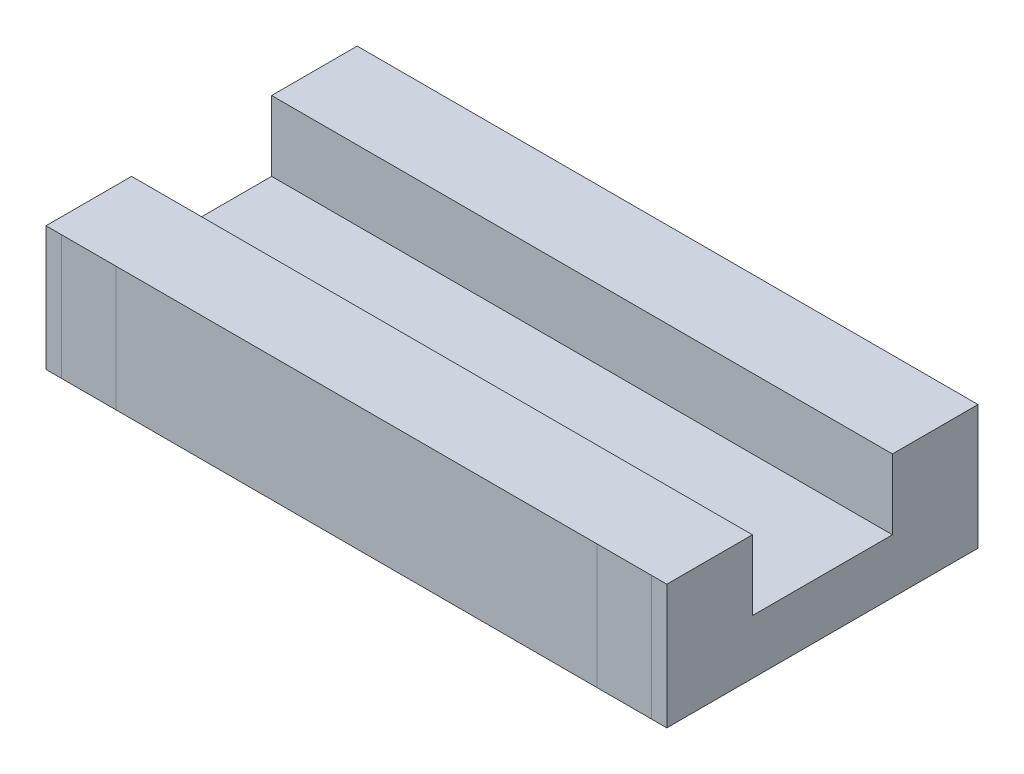
ISO-10303-21;
HEADER;
FILE_DESCRIPTION(('STEP AP214'),'2;1');
FILE_NAME('part.step','',(''),(''),'','','');
FILE_SCHEMA(('AUTOMOTIVE_DESIGN { 1 0 10303 214 1 1 1 1 }'));
ENDSEC;
DATA;
#1=APPLICATION_CONTEXT('core data for automotive mechanical design processes');
#2=APPLICATION_PROTOCOL_DEFINITION('international standard','automotive_design',2000,#1);
#3=PRODUCT_CONTEXT('',#1,'mechanical');
#4=PRODUCT('Part','Part','',(#3));
#5=PRODUCT_RELATED_PRODUCT_CATEGORY('part','',(#4));
#6=PRODUCT_DEFINITION_FORMATION('','',#4);
#7=PRODUCT_DEFINITION_CONTEXT('part definition',#1,'design');
#8=PRODUCT_DEFINITION('design','',#6,#7);
#9=PRODUCT_DEFINITION_SHAPE('','',#8);
#10=(LENGTH_UNIT() NAMED_UNIT(*) SI_UNIT(.MILLI.,.METRE.));
#11=(NAMED_UNIT(*) PLANE_ANGLE_UNIT() SI_UNIT($,.RADIAN.));
#12=(NAMED_UNIT(*) SI_UNIT($,.STERADIAN.) SOLID_ANGLE_UNIT());
#13=UNCERTAINTY_MEASURE_WITH_UNIT(LENGTH_MEASURE(1.E-05),#10,'distance_accuracy_value','');
#14=(GEOMETRIC_REPRESENTATION_CONTEXT(3) GLOBAL_UNCERTAINTY_ASSIGNED_CONTEXT((#13)) GLOBAL_UNIT_ASSIGNED_CONTEXT((#10,
#11,#12)) REPRESENTATION_CONTEXT('',''));
#15=CARTESIAN_POINT('',(0.,0.,0.));
#16=DIRECTION('',(0.,0.,1.));
#17=DIRECTION('',(1.,0.,0.));
#18=AXIS2_PLACEMENT_3D('',#15,#16,#17);
#19=CARTESIAN_POINT('',(-19.95,8.,10.));
#20=DIRECTION('',(0.,0.,-1.));
#21=DIRECTION('',(-1.,0.,0.));
#22=AXIS2_PLACEMENT_3D('',#19,#20,#21);
#23=PLANE('',#22);
#24=DIRECTION('',(0.,-1.,0.));
#25=VECTOR('',#24,1.);
#26=CARTESIAN_POINT('',(-18.95,8.,10.));
#27=LINE('',#26,#25);
#28=CARTESIAN_POINT('',(-18.95,8.,10.));
#29=VERTEX_POINT('',#28);
#30=CARTESIAN_POINT('',(-18.95,0.,10.));
#31=VERTEX_POINT('',#30);
#32=EDGE_CURVE('E11',#29,#31,#27,.T.);
#33=ORIENTED_EDGE('',*,*,#32,.F.);
#34=DIRECTION('',(1.,0.,0.));
#35=VECTOR('',#34,1.);
#36=CARTESIAN_POINT('',(-19.95,8.,10.));
#37=LINE('',#36,#35);
#38=CARTESIAN_POINT('',(-19.95,8.,10.));
#39=VERTEX_POINT('',#38);
#40=EDGE_CURVE('E195',#39,#29,#37,.T.);
#41=ORIENTED_EDGE('',*,*,#40,.F.);
#42=DIRECTION('',(0.,-1.,0.));
#43=VECTOR('',#42,1.);
#44=CARTESIAN_POINT('',(-19.95,8.,10.));
#45=LINE('',#44,#43);
#46=CARTESIAN_POINT('',(-19.95,0.,10.));
#47=VERTEX_POINT('',#46);
#48=EDGE_CURVE('E217',#39,#47,#45,.T.);
#49=ORIENTED_EDGE('',*,*,#48,.T.);
#50=DIRECTION('',(1.,0.,0.));
#51=VECTOR('',#50,1.);
#52=CARTESIAN_POINT('',(-19.95,0.,10.));
#53=LINE('',#52,#51);
#54=EDGE_CURVE('E212',#47,#31,#53,.T.);
#55=ORIENTED_EDGE('',*,*,#54,.T.);
#56=EDGE_LOOP('',(#33,#41,#49,#55));
#57=FACE_BOUND('',#56,.T.);
#58=ADVANCED_FACE('F38',(#57),#23,.F.);
#59=CARTESIAN_POINT('',(-19.95,8.,-10.));
#60=DIRECTION('',(0.,0.,1.));
#61=DIRECTION('',(1.,0.,0.));
#62=AXIS2_PLACEMENT_3D('',#59,#60,#61);
#63=PLANE('',#62);
#64=DIRECTION('',(0.,1.,0.));
#65=VECTOR('',#64,1.);
#66=CARTESIAN_POINT('',(-18.95,8.,-10.));
#67=LINE('',#66,#65);
#68=CARTESIAN_POINT('',(-18.95,0.,-10.));
#69=VERTEX_POINT('',#68);
#70=CARTESIAN_POINT('',(-18.95,8.,-10.));
#71=VERTEX_POINT('',#70);
#72=EDGE_CURVE('E48',#69,#71,#67,.T.);
#73=ORIENTED_EDGE('',*,*,#72,.F.);
#74=DIRECTION('',(-1.,0.,0.));
#75=VECTOR('',#74,1.);
#76=CARTESIAN_POINT('',(-19.95,0.,-10.));
#77=LINE('',#76,#75);
#78=CARTESIAN_POINT('',(-19.95,0.,-10.));
#79=VERTEX_POINT('',#78);
#80=EDGE_CURVE('E203',#69,#79,#77,.T.);
#81=ORIENTED_EDGE('',*,*,#80,.T.);
#82=DIRECTION('',(0.,-1.,0.));
#83=VECTOR('',#82,1.);
#84=CARTESIAN_POINT('',(-19.95,8.,-10.));
#85=LINE('',#84,#83);
#86=CARTESIAN_POINT('',(-19.95,8.,-10.));
#87=VERTEX_POINT('',#86);
#88=EDGE_CURVE('E220',#87,#79,#85,.T.);
#89=ORIENTED_EDGE('',*,*,#88,.F.);
#90=DIRECTION('',(-1.,0.,0.));
#91=VECTOR('',#90,1.);
#92=CARTESIAN_POINT('',(-19.95,8.,-10.));
#93=LINE('',#92,#91);
#94=EDGE_CURVE('E185',#71,#87,#93,.T.);
#95=ORIENTED_EDGE('',*,*,#94,.F.);
#96=EDGE_LOOP('',(#73,#81,#89,#95));
#97=FACE_BOUND('',#96,.T.);
#98=ADVANCED_FACE('F289',(#97),#63,.F.);
#99=CARTESIAN_POINT('',(0.,0.,0.));
#100=DIRECTION('',(0.,-1.,0.));
#101=DIRECTION('',(0.,0.,-1.));
#102=AXIS2_PLACEMENT_3D('',#99,#100,#101);
#103=PLANE('',#102);
#104=ORIENTED_EDGE('',*,*,#80,.F.);
#105=DIRECTION('',(0.,0.,1.));
#106=VECTOR('',#105,1.);
#107=CARTESIAN_POINT('',(-18.95,0.,0.));
#108=LINE('',#107,#106);
#109=EDGE_CURVE('E42',#69,#31,#108,.T.);
#110=ORIENTED_EDGE('',*,*,#109,.T.);
#111=ORIENTED_EDGE('',*,*,#54,.F.);
#112=DIRECTION('',(0.,0.,1.));
#113=VECTOR('',#112,1.);
#114=CARTESIAN_POINT('',(-19.95,0.,10.));
#115=LINE('',#114,#113);
#116=EDGE_CURVE('E208',#79,#47,#115,.T.);
#117=ORIENTED_EDGE('',*,*,#116,.F.);
#118=EDGE_LOOP('',(#104,#110,#111,#117));
#119=FACE_BOUND('',#118,.T.);
#120=ADVANCED_FACE('F271',(#119),#103,.T.);
#121=DIRECTION('',(0.,1.,0.));
#122=VECTOR('',#121,1.);
#123=CARTESIAN_POINT('',(-15.45,8.,10.));
#124=LINE('',#123,#122);
#125=CARTESIAN_POINT('',(-15.45,0.,10.));
#126=VERTEX_POINT('',#125);
#127=CARTESIAN_POINT('',(-15.45,8.,10.));
#128=VERTEX_POINT('',#127);
#129=EDGE_CURVE('E252',#126,#128,#124,.T.);
#130=ORIENTED_EDGE('',*,*,#129,.F.);
#131=CARTESIAN_POINT('',(15.45,0.,10.));
#132=VERTEX_POINT('',#131);
#133=EDGE_CURVE('E280',#126,#132,#53,.T.);
#134=ORIENTED_EDGE('',*,*,#133,.T.);
#135=DIRECTION('',(0.,1.,0.));
#136=VECTOR('',#135,1.);
#137=CARTESIAN_POINT('',(15.45,8.,10.));
#138=LINE('',#137,#136);
#139=CARTESIAN_POINT('',(15.45,8.,10.));
#140=VERTEX_POINT('',#139);
#141=EDGE_CURVE('E241',#132,#140,#138,.T.);
#142=ORIENTED_EDGE('',*,*,#141,.T.);
#143=EDGE_CURVE('E365',#128,#140,#37,.T.);
#144=ORIENTED_EDGE('',*,*,#143,.F.);
#145=EDGE_LOOP('',(#130,#134,#142,#144));
#146=FACE_BOUND('',#145,.T.);
#147=ADVANCED_FACE('F321',(#146),#23,.F.);
#148=DIRECTION('',(0.,-1.,0.));
#149=VECTOR('',#148,1.);
#150=CARTESIAN_POINT('',(-15.45,8.,-10.));
#151=LINE('',#150,#149);
#152=CARTESIAN_POINT('',(-15.45,8.,-10.));
#153=VERTEX_POINT('',#152);
#154=CARTESIAN_POINT('',(-15.45,0.,-10.));
#155=VERTEX_POINT('',#154);
#156=EDGE_CURVE('E249',#153,#155,#151,.T.);
#157=ORIENTED_EDGE('',*,*,#156,.F.);
#158=CARTESIAN_POINT('',(15.45,8.,-10.));
#159=VERTEX_POINT('',#158);
#160=EDGE_CURVE('E703',#159,#153,#93,.T.);
#161=ORIENTED_EDGE('',*,*,#160,.F.);
#162=DIRECTION('',(0.,-1.,0.));
#163=VECTOR('',#162,1.);
#164=CARTESIAN_POINT('',(15.45,8.,-10.));
#165=LINE('',#164,#163);
#166=CARTESIAN_POINT('',(15.45,0.,-10.));
#167=VERTEX_POINT('',#166);
#168=EDGE_CURVE('E238',#159,#167,#165,.T.);
#169=ORIENTED_EDGE('',*,*,#168,.T.);
#170=EDGE_CURVE('E292',#167,#155,#77,.T.);
#171=ORIENTED_EDGE('',*,*,#170,.T.);
#172=EDGE_LOOP('',(#157,#161,#169,#171));
#173=FACE_BOUND('',#172,.T.);
#174=ADVANCED_FACE('F329',(#173),#63,.F.);
#175=CARTESIAN_POINT('',(-8.,0.,-7.5));
#176=DIRECTION('',(0.,-1.,0.));
#177=DIRECTION('',(0.,0.,1.));
#178=AXIS2_PLACEMENT_3D('',#175,#176,#177);
#179=CIRCLE('',#178,1.5);
#180=CARTESIAN_POINT('',(-8.,0.,-6.));
#181=VERTEX_POINT('',#180);
#182=EDGE_CURVE('E383',#181,#181,#179,.T.);
#183=ORIENTED_EDGE('',*,*,#182,.F.);
#184=EDGE_LOOP('',(#183));
#185=FACE_BOUND('',#184,.T.);
#186=CARTESIAN_POINT('',(8.,0.,-7.5));
#187=DIRECTION('',(0.,-1.,0.));
#188=DIRECTION('',(0.,0.,-1.));
#189=AXIS2_PLACEMENT_3D('',#186,#187,#188);
#190=CIRCLE('',#189,1.5);
#191=CARTESIAN_POINT('',(8.,0.,-9.00000000000001));
#192=VERTEX_POINT('',#191);
#193=EDGE_CURVE('E389',#192,#192,#190,.T.);
#194=ORIENTED_EDGE('',*,*,#193,.F.);
#195=EDGE_LOOP('',(#194));
#196=FACE_BOUND('',#195,.T.);
#197=CARTESIAN_POINT('',(8.,0.,7.5));
#198=DIRECTION('',(0.,-1.,0.));
#199=DIRECTION('',(0.,0.,1.));
#200=AXIS2_PLACEMENT_3D('',#197,#198,#199);
#201=CIRCLE('',#200,1.5);
#202=CARTESIAN_POINT('',(8.,0.,8.99999999999999));
#203=VERTEX_POINT('',#202);
#204=EDGE_CURVE('E395',#203,#203,#201,.T.);
#205=ORIENTED_EDGE('',*,*,#204,.F.);
#206=EDGE_LOOP('',(#205));
#207=FACE_BOUND('',#206,.T.);
#208=CARTESIAN_POINT('',(-8.,0.,7.5));
#209=DIRECTION('',(0.,-1.,0.));
#210=DIRECTION('',(0.,0.,-1.));
#211=AXIS2_PLACEMENT_3D('',#208,#209,#210);
#212=CIRCLE('',#211,1.5);
#213=CARTESIAN_POINT('',(-8.,0.,6.));
#214=VERTEX_POINT('',#213);
#215=EDGE_CURVE('E377',#214,#214,#212,.T.);
#216=ORIENTED_EDGE('',*,*,#215,.F.);
#217=EDGE_LOOP('',(#216));
#218=FACE_BOUND('',#217,.T.);
#219=ORIENTED_EDGE('',*,*,#133,.F.);
#220=DIRECTION('',(0.,0.,-1.));
#221=VECTOR('',#220,1.);
#222=CARTESIAN_POINT('',(-15.45,0.,0.));
#223=LINE('',#222,#221);
#224=EDGE_CURVE('E245',#126,#155,#223,.T.);
#225=ORIENTED_EDGE('',*,*,#224,.T.);
#226=ORIENTED_EDGE('',*,*,#170,.F.);
#227=DIRECTION('',(0.,0.,-1.));
#228=VECTOR('',#227,1.);
#229=CARTESIAN_POINT('',(15.45,0.,0.));
#230=LINE('',#229,#228);
#231=EDGE_CURVE('E234',#132,#167,#230,.T.);
#232=ORIENTED_EDGE('',*,*,#231,.F.);
#233=EDGE_LOOP('',(#219,#225,#226,#232));
#234=FACE_BOUND('',#233,.T.);
#235=ADVANCED_FACE('F327',(#185,#196,#207,#218,#234),#103,.T.);
#236=ORIENTED_EDGE('',*,*,#141,.F.);
#237=CARTESIAN_POINT('',(18.95,0.,10.));
#238=VERTEX_POINT('',#237);
#239=EDGE_CURVE('E316',#132,#238,#53,.T.);
#240=ORIENTED_EDGE('',*,*,#239,.T.);
#241=DIRECTION('',(0.,-1.,0.));
#242=VECTOR('',#241,1.);
#243=CARTESIAN_POINT('',(18.95,8.,10.));
#244=LINE('',#243,#242);
#245=CARTESIAN_POINT('',(18.95,8.,10.));
#246=VERTEX_POINT('',#245);
#247=EDGE_CURVE('E230',#246,#238,#244,.T.);
#248=ORIENTED_EDGE('',*,*,#247,.F.);
#249=EDGE_CURVE('E326',#140,#246,#37,.T.);
#250=ORIENTED_EDGE('',*,*,#249,.F.);
#251=EDGE_LOOP('',(#236,#240,#248,#250));
#252=FACE_BOUND('',#251,.T.);
#253=ADVANCED_FACE('F325',(#252),#23,.F.);
#254=ORIENTED_EDGE('',*,*,#168,.F.);
#255=CARTESIAN_POINT('',(18.95,8.,-10.));
#256=VERTEX_POINT('',#255);
#257=EDGE_CURVE('E190',#256,#159,#93,.T.);
#258=ORIENTED_EDGE('',*,*,#257,.F.);
#259=DIRECTION('',(0.,1.,0.));
#260=VECTOR('',#259,1.);
#261=CARTESIAN_POINT('',(18.95,8.,-10.));
#262=LINE('',#261,#260);
#263=CARTESIAN_POINT('',(18.95,0.,-10.));
#264=VERTEX_POINT('',#263);
#265=EDGE_CURVE('E227',#264,#256,#262,.T.);
#266=ORIENTED_EDGE('',*,*,#265,.F.);
#267=EDGE_CURVE('E209',#264,#167,#77,.T.);
#268=ORIENTED_EDGE('',*,*,#267,.T.);
#269=EDGE_LOOP('',(#254,#258,#266,#268));
#270=FACE_BOUND('',#269,.T.);
#271=ADVANCED_FACE('F299',(#270),#63,.F.);
#272=ORIENTED_EDGE('',*,*,#239,.F.);
#273=ORIENTED_EDGE('',*,*,#231,.T.);
#274=ORIENTED_EDGE('',*,*,#267,.F.);
#275=DIRECTION('',(0.,0.,1.));
#276=VECTOR('',#275,1.);
#277=CARTESIAN_POINT('',(18.95,0.,0.));
#278=LINE('',#277,#276);
#279=EDGE_CURVE('E226',#264,#238,#278,.T.);
#280=ORIENTED_EDGE('',*,*,#279,.T.);
#281=EDGE_LOOP('',(#272,#273,#274,#280));
#282=FACE_BOUND('',#281,.T.);
#283=ADVANCED_FACE('F305',(#282),#103,.T.);
#284=EDGE_CURVE('E199',#29,#128,#37,.T.);
#285=ORIENTED_EDGE('',*,*,#284,.F.);
#286=ORIENTED_EDGE('',*,*,#32,.T.);
#287=EDGE_CURVE('E214',#31,#126,#53,.T.);
#288=ORIENTED_EDGE('',*,*,#287,.T.);
#289=ORIENTED_EDGE('',*,*,#129,.T.);
#290=EDGE_LOOP('',(#285,#286,#288,#289));
#291=FACE_BOUND('',#290,.T.);
#292=ADVANCED_FACE('F337',(#291),#23,.F.);
#293=EDGE_CURVE('E291',#155,#69,#77,.T.);
#294=ORIENTED_EDGE('',*,*,#293,.T.);
#295=ORIENTED_EDGE('',*,*,#72,.T.);
#296=EDGE_CURVE('E702',#153,#71,#93,.T.);
#297=ORIENTED_EDGE('',*,*,#296,.F.);
#298=ORIENTED_EDGE('',*,*,#156,.T.);
#299=EDGE_LOOP('',(#294,#295,#297,#298));
#300=FACE_BOUND('',#299,.T.);
#301=ADVANCED_FACE('F360',(#300),#63,.F.);
#302=ORIENTED_EDGE('',*,*,#109,.F.);
#303=ORIENTED_EDGE('',*,*,#293,.F.);
#304=ORIENTED_EDGE('',*,*,#224,.F.);
#305=ORIENTED_EDGE('',*,*,#287,.F.);
#306=EDGE_LOOP('',(#302,#303,#304,#305));
#307=FACE_BOUND('',#306,.T.);
#308=ADVANCED_FACE('F276',(#307),#103,.T.);
#309=CARTESIAN_POINT('',(0.,8.,0.));
#310=DIRECTION('',(0.,-1.,0.));
#311=DIRECTION('',(0.,0.,-1.));
#312=AXIS2_PLACEMENT_3D('',#309,#310,#311);
#313=PLANE('',#312);
#314=DIRECTION('',(0.,0.,-1.));
#315=VECTOR('',#314,1.);
#316=CARTESIAN_POINT('',(19.95,8.,10.));
#317=LINE('',#316,#315);
#318=CARTESIAN_POINT('',(19.95,8.,10.));
#319=VERTEX_POINT('',#318);
#320=CARTESIAN_POINT('',(19.95,8.,4.5));
#321=VERTEX_POINT('',#320);
#322=EDGE_CURVE('E182',#319,#321,#317,.T.);
#323=ORIENTED_EDGE('',*,*,#322,.T.);
#324=DIRECTION('',(1.,0.,0.));
#325=VECTOR('',#324,1.);
#326=CARTESIAN_POINT('',(-19.95,8.,4.5));
#327=LINE('',#326,#325);
#328=CARTESIAN_POINT('',(-19.95,8.,4.5));
#329=VERTEX_POINT('',#328);
#330=EDGE_CURVE('E171',#329,#321,#327,.T.);
#331=ORIENTED_EDGE('',*,*,#330,.F.);
#332=DIRECTION('',(0.,0.,1.));
#333=VECTOR('',#332,1.);
#334=CARTESIAN_POINT('',(-19.95,8.,10.));
#335=LINE('',#334,#333);
#336=EDGE_CURVE('E189',#329,#39,#335,.T.);
#337=ORIENTED_EDGE('',*,*,#336,.T.);
#338=ORIENTED_EDGE('',*,*,#40,.T.);
#339=ORIENTED_EDGE('',*,*,#284,.T.);
#340=ORIENTED_EDGE('',*,*,#143,.T.);
#341=ORIENTED_EDGE('',*,*,#249,.T.);
#342=EDGE_CURVE('E194',#246,#319,#37,.T.);
#343=ORIENTED_EDGE('',*,*,#342,.T.);
#344=EDGE_LOOP('',(#323,#331,#337,#338,#339,#340,#341,#343));
#345=FACE_BOUND('',#344,.T.);
#346=ADVANCED_FACE('F357',(#345),#313,.F.);
#347=CARTESIAN_POINT('',(19.95,8.,10.));
#348=DIRECTION('',(-1.,0.,0.));
#349=DIRECTION('',(0.,0.,1.));
#350=AXIS2_PLACEMENT_3D('',#347,#348,#349);
#351=PLANE('',#350);
#352=DIRECTION('',(0.,0.,-1.));
#353=VECTOR('',#352,1.);
#354=CARTESIAN_POINT('',(19.95,3.5,4.5));
#355=LINE('',#354,#353);
#356=CARTESIAN_POINT('',(19.95,3.5,4.5));
#357=VERTEX_POINT('',#356);
#358=CARTESIAN_POINT('',(19.95,3.5,-4.5));
#359=VERTEX_POINT('',#358);
#360=EDGE_CURVE('E162',#357,#359,#355,.T.);
#361=ORIENTED_EDGE('',*,*,#360,.F.);
#362=DIRECTION('',(0.,1.,0.));
#363=VECTOR('',#362,1.);
#364=CARTESIAN_POINT('',(19.95,3.5,4.5));
#365=LINE('',#364,#363);
#366=EDGE_CURVE('E204',#357,#321,#365,.T.);
#367=ORIENTED_EDGE('',*,*,#366,.T.);
#368=ORIENTED_EDGE('',*,*,#322,.F.);
#369=DIRECTION('',(0.,-1.,0.));
#370=VECTOR('',#369,1.);
#371=CARTESIAN_POINT('',(19.95,8.,10.));
#372=LINE('',#371,#370);
#373=CARTESIAN_POINT('',(19.95,0.,10.));
#374=VERTEX_POINT('',#373);
#375=EDGE_CURVE('E198',#319,#374,#372,.T.);
#376=ORIENTED_EDGE('',*,*,#375,.T.);
#377=DIRECTION('',(0.,0.,-1.));
#378=VECTOR('',#377,1.);
#379=CARTESIAN_POINT('',(19.95,0.,10.));
#380=LINE('',#379,#378);
#381=CARTESIAN_POINT('',(19.95,0.,-10.));
#382=VERTEX_POINT('',#381);
#383=EDGE_CURVE('E200',#374,#382,#380,.T.);
#384=ORIENTED_EDGE('',*,*,#383,.T.);
#385=DIRECTION('',(0.,-1.,0.));
#386=VECTOR('',#385,1.);
#387=CARTESIAN_POINT('',(19.95,8.,-10.));
#388=LINE('',#387,#386);
#389=CARTESIAN_POINT('',(19.95,8.,-10.));
#390=VERTEX_POINT('',#389);
#391=EDGE_CURVE('E223',#390,#382,#388,.T.);
#392=ORIENTED_EDGE('',*,*,#391,.F.);
#393=CARTESIAN_POINT('',(19.95,8.,-4.5));
#394=VERTEX_POINT('',#393);
#395=EDGE_CURVE('E175',#394,#390,#317,.T.);
#396=ORIENTED_EDGE('',*,*,#395,.F.);
#397=DIRECTION('',(0.,1.,0.));
#398=VECTOR('',#397,1.);
#399=CARTESIAN_POINT('',(19.95,3.5,-4.5));
#400=LINE('',#399,#398);
#401=EDGE_CURVE('E155',#359,#394,#400,.T.);
#402=ORIENTED_EDGE('',*,*,#401,.F.);
#403=EDGE_LOOP('',(#361,#367,#368,#376,#384,#392,#396,#402));
#404=FACE_BOUND('',#403,.T.);
#405=ADVANCED_FACE('F40',(#404),#351,.F.);
#406=EDGE_CURVE('E205',#382,#264,#77,.T.);
#407=ORIENTED_EDGE('',*,*,#406,.T.);
#408=ORIENTED_EDGE('',*,*,#265,.T.);
#409=EDGE_CURVE('E186',#390,#256,#93,.T.);
#410=ORIENTED_EDGE('',*,*,#409,.F.);
#411=ORIENTED_EDGE('',*,*,#391,.T.);
#412=EDGE_LOOP('',(#407,#408,#410,#411));
#413=FACE_BOUND('',#412,.T.);
#414=ADVANCED_FACE('F309',(#413),#63,.F.);
#415=CARTESIAN_POINT('',(-19.95,8.,10.));
#416=DIRECTION('',(1.,0.,0.));
#417=DIRECTION('',(0.,0.,-1.));
#418=AXIS2_PLACEMENT_3D('',#415,#416,#417);
#419=PLANE('',#418);
#420=ORIENTED_EDGE('',*,*,#336,.F.);
#421=DIRECTION('',(0.,1.,0.));
#422=VECTOR('',#421,1.);
#423=CARTESIAN_POINT('',(-19.95,3.5,4.5));
#424=LINE('',#423,#422);
#425=CARTESIAN_POINT('',(-19.95,3.5,4.5));
#426=VERTEX_POINT('',#425);
#427=EDGE_CURVE('E177',#426,#329,#424,.T.);
#428=ORIENTED_EDGE('',*,*,#427,.F.);
#429=DIRECTION('',(0.,0.,1.));
#430=VECTOR('',#429,1.);
#431=CARTESIAN_POINT('',(-19.95,3.5,4.5));
#432=LINE('',#431,#430);
#433=CARTESIAN_POINT('',(-19.95,3.5,-4.5));
#434=VERTEX_POINT('',#433);
#435=EDGE_CURVE('E161',#434,#426,#432,.T.);
#436=ORIENTED_EDGE('',*,*,#435,.F.);
#437=DIRECTION('',(0.,1.,0.));
#438=VECTOR('',#437,1.);
#439=CARTESIAN_POINT('',(-19.95,3.5,-4.5));
#440=LINE('',#439,#438);
#441=CARTESIAN_POINT('',(-19.95,8.,-4.5));
#442=VERTEX_POINT('',#441);
#443=EDGE_CURVE('E158',#434,#442,#440,.T.);
#444=ORIENTED_EDGE('',*,*,#443,.T.);
#445=EDGE_CURVE('E191',#87,#442,#335,.T.);
#446=ORIENTED_EDGE('',*,*,#445,.F.);
#447=ORIENTED_EDGE('',*,*,#88,.T.);
#448=ORIENTED_EDGE('',*,*,#116,.T.);
#449=ORIENTED_EDGE('',*,*,#48,.F.);
#450=EDGE_LOOP('',(#420,#428,#436,#444,#446,#447,#448,#449));
#451=FACE_BOUND('',#450,.T.);
#452=ADVANCED_FACE('F284',(#451),#419,.F.);
#453=ORIENTED_EDGE('',*,*,#342,.F.);
#454=ORIENTED_EDGE('',*,*,#247,.T.);
#455=EDGE_CURVE('E211',#238,#374,#53,.T.);
#456=ORIENTED_EDGE('',*,*,#455,.T.);
#457=ORIENTED_EDGE('',*,*,#375,.F.);
#458=EDGE_LOOP('',(#453,#454,#456,#457));
#459=FACE_BOUND('',#458,.T.);
#460=ADVANCED_FACE('F344',(#459),#23,.F.);
#461=ORIENTED_EDGE('',*,*,#445,.T.);
#462=DIRECTION('',(-1.,0.,0.));
#463=VECTOR('',#462,1.);
#464=CARTESIAN_POINT('',(-19.95,8.,-4.5));
#465=LINE('',#464,#463);
#466=EDGE_CURVE('E369',#394,#442,#465,.T.);
#467=ORIENTED_EDGE('',*,*,#466,.F.);
#468=ORIENTED_EDGE('',*,*,#395,.T.);
#469=ORIENTED_EDGE('',*,*,#409,.T.);
#470=ORIENTED_EDGE('',*,*,#257,.T.);
#471=ORIENTED_EDGE('',*,*,#160,.T.);
#472=ORIENTED_EDGE('',*,*,#296,.T.);
#473=ORIENTED_EDGE('',*,*,#94,.T.);
#474=EDGE_LOOP('',(#461,#467,#468,#469,#470,#471,#472,#473));
#475=FACE_BOUND('',#474,.T.);
#476=ADVANCED_FACE('F351',(#475),#313,.F.);
#477=ORIENTED_EDGE('',*,*,#279,.F.);
#478=ORIENTED_EDGE('',*,*,#406,.F.);
#479=ORIENTED_EDGE('',*,*,#383,.F.);
#480=ORIENTED_EDGE('',*,*,#455,.F.);
#481=EDGE_LOOP('',(#477,#478,#479,#480));
#482=FACE_BOUND('',#481,.T.);
#483=ADVANCED_FACE('F313',(#482),#103,.T.);
#484=CARTESIAN_POINT('',(-19.95,3.5,4.5));
#485=DIRECTION('',(0.,0.,1.));
#486=DIRECTION('',(1.,0.,0.));
#487=AXIS2_PLACEMENT_3D('',#484,#485,#486);
#488=PLANE('',#487);
#489=ORIENTED_EDGE('',*,*,#330,.T.);
#490=ORIENTED_EDGE('',*,*,#366,.F.);
#491=DIRECTION('',(1.,0.,0.));
#492=VECTOR('',#491,1.);
#493=CARTESIAN_POINT('',(-19.95,3.5,4.5));
#494=LINE('',#493,#492);
#495=EDGE_CURVE('E168',#426,#357,#494,.T.);
#496=ORIENTED_EDGE('',*,*,#495,.F.);
#497=ORIENTED_EDGE('',*,*,#427,.T.);
#498=EDGE_LOOP('',(#489,#490,#496,#497));
#499=FACE_BOUND('',#498,.T.);
#500=ADVANCED_FACE('F374',(#499),#488,.F.);
#501=CARTESIAN_POINT('',(-19.95,3.5,-4.5));
#502=DIRECTION('',(0.,0.,-1.));
#503=DIRECTION('',(-1.,0.,0.));
#504=AXIS2_PLACEMENT_3D('',#501,#502,#503);
#505=PLANE('',#504);
#506=ORIENTED_EDGE('',*,*,#466,.T.);
#507=ORIENTED_EDGE('',*,*,#443,.F.);
#508=DIRECTION('',(-1.,0.,0.));
#509=VECTOR('',#508,1.);
#510=CARTESIAN_POINT('',(-19.95,3.5,-4.5));
#511=LINE('',#510,#509);
#512=EDGE_CURVE('E151',#359,#434,#511,.T.);
#513=ORIENTED_EDGE('',*,*,#512,.F.);
#514=ORIENTED_EDGE('',*,*,#401,.T.);
#515=EDGE_LOOP('',(#506,#507,#513,#514));
#516=FACE_BOUND('',#515,.T.);
#517=ADVANCED_FACE('F153',(#516),#505,.F.);
#518=CARTESIAN_POINT('',(0.,3.5,0.));
#519=DIRECTION('',(0.,-1.,0.));
#520=DIRECTION('',(0.,0.,-1.));
#521=AXIS2_PLACEMENT_3D('',#518,#519,#520);
#522=PLANE('',#521);
#523=ORIENTED_EDGE('',*,*,#360,.T.);
#524=ORIENTED_EDGE('',*,*,#512,.T.);
#525=ORIENTED_EDGE('',*,*,#435,.T.);
#526=ORIENTED_EDGE('',*,*,#495,.T.);
#527=EDGE_LOOP('',(#523,#524,#525,#526));
#528=FACE_BOUND('',#527,.T.);
#529=ADVANCED_FACE('F166',(#528),#522,.F.);
#530=CARTESIAN_POINT('',(-8.,4.,7.5));
#531=DIRECTION('',(0.,-1.,0.));
#532=DIRECTION('',(0.,0.,-1.));
#533=AXIS2_PLACEMENT_3D('',#530,#531,#532);
#534=CYLINDRICAL_SURFACE('',#533,1.5);
#535=CARTESIAN_POINT('',(-8.,4.,7.5));
#536=DIRECTION('',(0.,-1.,0.));
#537=DIRECTION('',(0.,0.,-1.));
#538=AXIS2_PLACEMENT_3D('',#535,#536,#537);
#539=CIRCLE('',#538,1.5);
#540=CARTESIAN_POINT('',(-8.,4.,6.));
#541=VERTEX_POINT('',#540);
#542=EDGE_CURVE('E371',#541,#541,#539,.T.);
#543=ORIENTED_EDGE('',*,*,#542,.F.);
#544=EDGE_LOOP('',(#543));
#545=FACE_BOUND('',#544,.T.);
#546=ORIENTED_EDGE('',*,*,#215,.T.);
#547=EDGE_LOOP('',(#546));
#548=FACE_BOUND('',#547,.T.);
#549=ADVANCED_FACE('F413',(#545,#548),#534,.F.);
#550=CARTESIAN_POINT('',(-8.,4.,7.5));
#551=DIRECTION('',(0.,-1.,0.));
#552=DIRECTION('',(0.,0.,-1.));
#553=AXIS2_PLACEMENT_3D('',#550,#551,#552);
#554=PLANE('',#553);
#555=ORIENTED_EDGE('',*,*,#542,.T.);
#556=EDGE_LOOP('',(#555));
#557=FACE_BOUND('',#556,.T.);
#558=ADVANCED_FACE('F406',(#557),#554,.T.);
#559=CARTESIAN_POINT('',(8.,4.,7.5));
#560=DIRECTION('',(0.,-1.,0.));
#561=DIRECTION('',(0.,0.,-1.));
#562=AXIS2_PLACEMENT_3D('',#559,#560,#561);
#563=CYLINDRICAL_SURFACE('',#562,1.5);
#564=CARTESIAN_POINT('',(8.,4.,7.5));
#565=DIRECTION('',(0.,-1.,0.));
#566=DIRECTION('',(0.,0.,1.));
#567=AXIS2_PLACEMENT_3D('',#564,#565,#566);
#568=CIRCLE('',#567,1.5);
#569=CARTESIAN_POINT('',(8.,4.,8.99999999999999));
#570=VERTEX_POINT('',#569);
#571=EDGE_CURVE('E380',#570,#570,#568,.T.);
#572=ORIENTED_EDGE('',*,*,#571,.F.);
#573=EDGE_LOOP('',(#572));
#574=FACE_BOUND('',#573,.T.);
#575=ORIENTED_EDGE('',*,*,#204,.T.);
#576=EDGE_LOOP('',(#575));
#577=FACE_BOUND('',#576,.T.);
#578=ADVANCED_FACE('F403',(#574,#577),#563,.F.);
#579=CARTESIAN_POINT('',(8.,4.,7.5));
#580=DIRECTION('',(0.,1.,0.));
#581=DIRECTION('',(0.,0.,1.));
#582=AXIS2_PLACEMENT_3D('',#579,#580,#581);
#583=PLANE('',#582);
#584=ORIENTED_EDGE('',*,*,#571,.T.);
#585=EDGE_LOOP('',(#584));
#586=FACE_BOUND('',#585,.T.);
#587=ADVANCED_FACE('F401',(#586),#583,.F.);
#588=CARTESIAN_POINT('',(8.,4.,-7.5));
#589=DIRECTION('',(0.,-1.,0.));
#590=DIRECTION('',(0.,0.,-1.));
#591=AXIS2_PLACEMENT_3D('',#588,#589,#590);
#592=CYLINDRICAL_SURFACE('',#591,1.5);
#593=CARTESIAN_POINT('',(8.,4.,-7.5));
#594=DIRECTION('',(0.,-1.,0.));
#595=DIRECTION('',(0.,0.,-1.));
#596=AXIS2_PLACEMENT_3D('',#593,#594,#595);
#597=CIRCLE('',#596,1.5);
#598=CARTESIAN_POINT('',(8.,4.,-9.00000000000001));
#599=VERTEX_POINT('',#598);
#600=EDGE_CURVE('E392',#599,#599,#597,.T.);
#601=ORIENTED_EDGE('',*,*,#600,.F.);
#602=EDGE_LOOP('',(#601));
#603=FACE_BOUND('',#602,.T.);
#604=ORIENTED_EDGE('',*,*,#193,.T.);
#605=EDGE_LOOP('',(#604));
#606=FACE_BOUND('',#605,.T.);
#607=ADVANCED_FACE('F464',(#603,#606),#592,.F.);
#608=CARTESIAN_POINT('',(8.,4.,-7.5));
#609=DIRECTION('',(0.,-1.,0.));
#610=DIRECTION('',(0.,0.,-1.));
#611=AXIS2_PLACEMENT_3D('',#608,#609,#610);
#612=PLANE('',#611);
#613=ORIENTED_EDGE('',*,*,#600,.T.);
#614=EDGE_LOOP('',(#613));
#615=FACE_BOUND('',#614,.T.);
#616=ADVANCED_FACE('F473',(#615),#612,.T.);
#617=CARTESIAN_POINT('',(-8.,4.,-7.5));
#618=DIRECTION('',(0.,-1.,0.));
#619=DIRECTION('',(0.,0.,-1.));
#620=AXIS2_PLACEMENT_3D('',#617,#618,#619);
#621=CYLINDRICAL_SURFACE('',#620,1.5);
#622=CARTESIAN_POINT('',(-8.,4.,-7.5));
#623=DIRECTION('',(0.,-1.,0.));
#624=DIRECTION('',(0.,0.,1.));
#625=AXIS2_PLACEMENT_3D('',#622,#623,#624);
#626=CIRCLE('',#625,1.5);
#627=CARTESIAN_POINT('',(-8.,4.,-6.));
#628=VERTEX_POINT('',#627);
#629=EDGE_CURVE('E386',#628,#628,#626,.T.);
#630=ORIENTED_EDGE('',*,*,#629,.F.);
#631=EDGE_LOOP('',(#630));
#632=FACE_BOUND('',#631,.T.);
#633=ORIENTED_EDGE('',*,*,#182,.T.);
#634=EDGE_LOOP('',(#633));
#635=FACE_BOUND('',#634,.T.);
#636=ADVANCED_FACE('F483',(#632,#635),#621,.F.);
#637=CARTESIAN_POINT('',(-8.,4.,-7.5));
#638=DIRECTION('',(0.,1.,0.));
#639=DIRECTION('',(0.,0.,1.));
#640=AXIS2_PLACEMENT_3D('',#637,#638,#639);
#641=PLANE('',#640);
#642=ORIENTED_EDGE('',*,*,#629,.T.);
#643=EDGE_LOOP('',(#642));
#644=FACE_BOUND('',#643,.T.);
#645=ADVANCED_FACE('F493',(#644),#641,.F.);
#646=CLOSED_SHELL('',(#58,#98,#120,#147,#174,#235,#253,#271,#283,#292,#301,#308,#346,#405,#414,
#452,#460,#476,#483,#500,#517,#529,#549,#558,#578,#587,#607,#616,#636,#645));
#647=MANIFOLD_SOLID_BREP('B2',#646);
#648=ADVANCED_BREP_SHAPE_REPRESENTATION('',(#18,#647),#14);
#649=SHAPE_DEFINITION_REPRESENTATION(#9,#648);
ENDSEC;
END-ISO-10303-21;
